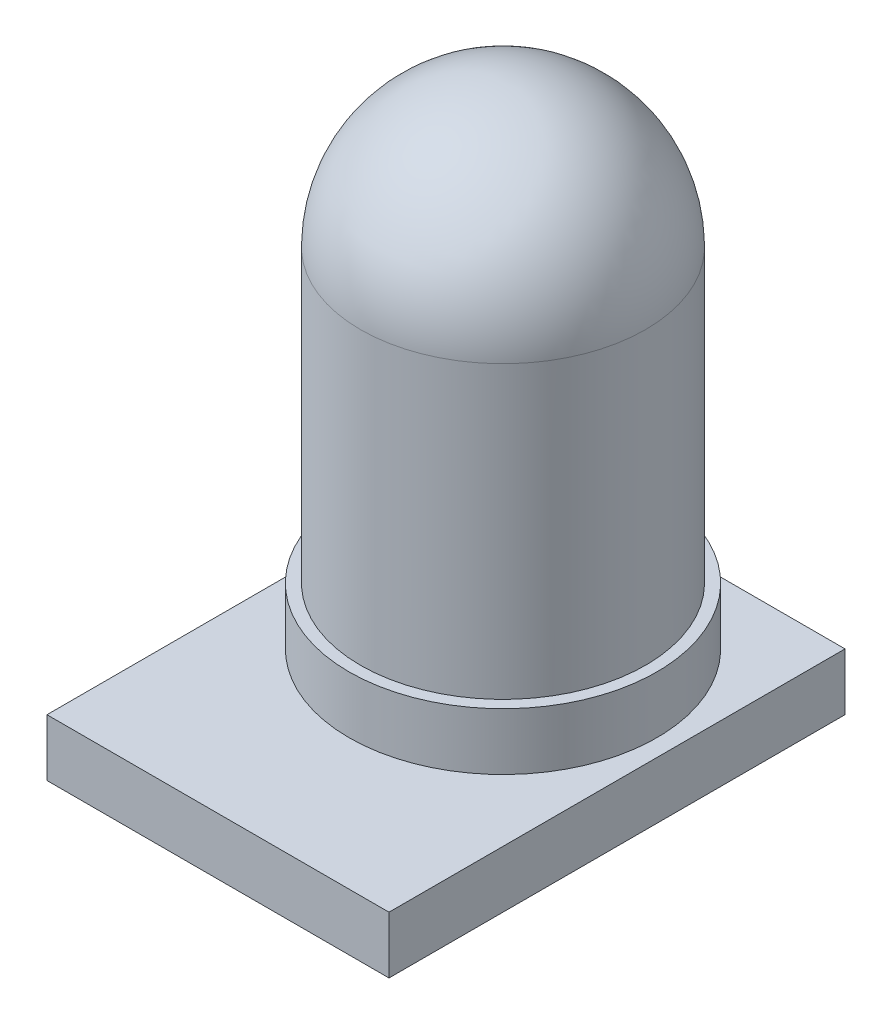
ISO-10303-21;
HEADER;
FILE_DESCRIPTION(('STEP AP214'),'2;1');
FILE_NAME('part.step','',(''),(''),'','','');
FILE_SCHEMA(('AUTOMOTIVE_DESIGN { 1 0 10303 214 1 1 1 1 }'));
ENDSEC;
DATA;
#1=APPLICATION_CONTEXT('core data for automotive mechanical design processes');
#2=APPLICATION_PROTOCOL_DEFINITION('international standard','automotive_design',2000,#1);
#3=PRODUCT_CONTEXT('',#1,'mechanical');
#4=PRODUCT('Part','Part','',(#3));
#5=PRODUCT_RELATED_PRODUCT_CATEGORY('part','',(#4));
#6=PRODUCT_DEFINITION_FORMATION('','',#4);
#7=PRODUCT_DEFINITION_CONTEXT('part definition',#1,'design');
#8=PRODUCT_DEFINITION('design','',#6,#7);
#9=PRODUCT_DEFINITION_SHAPE('','',#8);
#10=(LENGTH_UNIT() NAMED_UNIT(*) SI_UNIT(.MILLI.,.METRE.));
#11=(NAMED_UNIT(*) PLANE_ANGLE_UNIT() SI_UNIT($,.RADIAN.));
#12=(NAMED_UNIT(*) SI_UNIT($,.STERADIAN.) SOLID_ANGLE_UNIT());
#13=UNCERTAINTY_MEASURE_WITH_UNIT(LENGTH_MEASURE(1.E-05),#10,'distance_accuracy_value','');
#14=(GEOMETRIC_REPRESENTATION_CONTEXT(3) GLOBAL_UNCERTAINTY_ASSIGNED_CONTEXT((#13)) GLOBAL_UNIT_ASSIGNED_CONTEXT((#10,
#11,#12)) REPRESENTATION_CONTEXT('',''));
#15=CARTESIAN_POINT('',(0.,0.,0.));
#16=DIRECTION('',(0.,0.,1.));
#17=DIRECTION('',(1.,0.,0.));
#18=AXIS2_PLACEMENT_3D('',#15,#16,#17);
#19=CARTESIAN_POINT('',(3.,-1.,-3.));
#20=DIRECTION('',(-1.,0.,0.));
#21=DIRECTION('',(0.,0.,1.));
#22=AXIS2_PLACEMENT_3D('',#19,#20,#21);
#23=PLANE('',#22);
#24=DIRECTION('',(0.,0.,1.));
#25=VECTOR('',#24,1.);
#26=CARTESIAN_POINT('',(3.,0.,-3.));
#27=LINE('',#26,#25);
#28=CARTESIAN_POINT('',(3.,0.,-3.));
#29=VERTEX_POINT('',#28);
#30=CARTESIAN_POINT('',(3.,0.,5.));
#31=VERTEX_POINT('',#30);
#32=EDGE_CURVE('E104',#29,#31,#27,.T.);
#33=ORIENTED_EDGE('',*,*,#32,.T.);
#34=DIRECTION('',(0.,1.,0.));
#35=VECTOR('',#34,1.);
#36=CARTESIAN_POINT('',(3.,-1.,5.));
#37=LINE('',#36,#35);
#38=CARTESIAN_POINT('',(3.,-1.,5.));
#39=VERTEX_POINT('',#38);
#40=EDGE_CURVE('E95',#39,#31,#37,.T.);
#41=ORIENTED_EDGE('',*,*,#40,.F.);
#42=DIRECTION('',(0.,0.,1.));
#43=VECTOR('',#42,1.);
#44=CARTESIAN_POINT('',(3.,-1.,-3.));
#45=LINE('',#44,#43);
#46=CARTESIAN_POINT('',(3.,-1.,-3.));
#47=VERTEX_POINT('',#46);
#48=EDGE_CURVE('E87',#47,#39,#45,.T.);
#49=ORIENTED_EDGE('',*,*,#48,.F.);
#50=DIRECTION('',(0.,1.,0.));
#51=VECTOR('',#50,1.);
#52=CARTESIAN_POINT('',(3.,-1.,-3.));
#53=LINE('',#52,#51);
#54=EDGE_CURVE('E100',#47,#29,#53,.T.);
#55=ORIENTED_EDGE('',*,*,#54,.T.);
#56=EDGE_LOOP('',(#33,#41,#49,#55));
#57=FACE_BOUND('',#56,.T.);
#58=ADVANCED_FACE('F34',(#57),#23,.F.);
#59=CARTESIAN_POINT('',(0.,-1.,5.));
#60=DIRECTION('',(0.,0.,-1.));
#61=DIRECTION('',(-1.,0.,0.));
#62=AXIS2_PLACEMENT_3D('',#59,#60,#61);
#63=PLANE('',#62);
#64=DIRECTION('',(-1.,0.,0.));
#65=VECTOR('',#64,1.);
#66=CARTESIAN_POINT('',(0.,0.,5.));
#67=LINE('',#66,#65);
#68=CARTESIAN_POINT('',(-3.,0.,5.));
#69=VERTEX_POINT('',#68);
#70=EDGE_CURVE('E93',#31,#69,#67,.T.);
#71=ORIENTED_EDGE('',*,*,#70,.T.);
#72=DIRECTION('',(0.,1.,0.));
#73=VECTOR('',#72,1.);
#74=CARTESIAN_POINT('',(-3.,-1.,5.));
#75=LINE('',#74,#73);
#76=CARTESIAN_POINT('',(-3.,-1.,5.));
#77=VERTEX_POINT('',#76);
#78=EDGE_CURVE('E91',#77,#69,#75,.T.);
#79=ORIENTED_EDGE('',*,*,#78,.F.);
#80=DIRECTION('',(-1.,0.,0.));
#81=VECTOR('',#80,1.);
#82=CARTESIAN_POINT('',(3.,-1.,5.));
#83=LINE('',#82,#81);
#84=EDGE_CURVE('E81',#39,#77,#83,.T.);
#85=ORIENTED_EDGE('',*,*,#84,.F.);
#86=ORIENTED_EDGE('',*,*,#40,.T.);
#87=EDGE_LOOP('',(#71,#79,#85,#86));
#88=FACE_BOUND('',#87,.T.);
#89=ADVANCED_FACE('F92',(#88),#63,.F.);
#90=CARTESIAN_POINT('',(-3.,-1.,5.));
#91=DIRECTION('',(1.,0.,0.));
#92=DIRECTION('',(0.,0.,-1.));
#93=AXIS2_PLACEMENT_3D('',#90,#91,#92);
#94=PLANE('',#93);
#95=DIRECTION('',(0.,0.,-1.));
#96=VECTOR('',#95,1.);
#97=CARTESIAN_POINT('',(-3.,0.,5.));
#98=LINE('',#97,#96);
#99=CARTESIAN_POINT('',(-3.,0.,-3.));
#100=VERTEX_POINT('',#99);
#101=EDGE_CURVE('E108',#69,#100,#98,.T.);
#102=ORIENTED_EDGE('',*,*,#101,.T.);
#103=DIRECTION('',(0.,1.,0.));
#104=VECTOR('',#103,1.);
#105=CARTESIAN_POINT('',(-3.,-1.,-3.));
#106=LINE('',#105,#104);
#107=CARTESIAN_POINT('',(-3.,-1.,-3.));
#108=VERTEX_POINT('',#107);
#109=EDGE_CURVE('E96',#108,#100,#106,.T.);
#110=ORIENTED_EDGE('',*,*,#109,.F.);
#111=DIRECTION('',(0.,0.,-1.));
#112=VECTOR('',#111,1.);
#113=CARTESIAN_POINT('',(-3.,-1.,5.));
#114=LINE('',#113,#112);
#115=EDGE_CURVE('E84',#77,#108,#114,.T.);
#116=ORIENTED_EDGE('',*,*,#115,.F.);
#117=ORIENTED_EDGE('',*,*,#78,.T.);
#118=EDGE_LOOP('',(#102,#110,#116,#117));
#119=FACE_BOUND('',#118,.T.);
#120=ADVANCED_FACE('F98',(#119),#94,.F.);
#121=CARTESIAN_POINT('',(0.,-1.,-3.));
#122=DIRECTION('',(0.,0.,1.));
#123=DIRECTION('',(1.,0.,0.));
#124=AXIS2_PLACEMENT_3D('',#121,#122,#123);
#125=PLANE('',#124);
#126=DIRECTION('',(1.,0.,0.));
#127=VECTOR('',#126,1.);
#128=CARTESIAN_POINT('',(0.,0.,-3.));
#129=LINE('',#128,#127);
#130=EDGE_CURVE('E69',#100,#29,#129,.T.);
#131=ORIENTED_EDGE('',*,*,#130,.T.);
#132=ORIENTED_EDGE('',*,*,#54,.F.);
#133=DIRECTION('',(1.,0.,0.));
#134=VECTOR('',#133,1.);
#135=CARTESIAN_POINT('',(-3.,-1.,-3.));
#136=LINE('',#135,#134);
#137=EDGE_CURVE('E52',#108,#47,#136,.T.);
#138=ORIENTED_EDGE('',*,*,#137,.F.);
#139=ORIENTED_EDGE('',*,*,#109,.T.);
#140=EDGE_LOOP('',(#131,#132,#138,#139));
#141=FACE_BOUND('',#140,.T.);
#142=ADVANCED_FACE('F139',(#141),#125,.F.);
#143=CARTESIAN_POINT('',(0.,-1.,0.));
#144=DIRECTION('',(0.,-1.,0.));
#145=DIRECTION('',(0.,0.,-1.));
#146=AXIS2_PLACEMENT_3D('',#143,#144,#145);
#147=PLANE('',#146);
#148=ORIENTED_EDGE('',*,*,#48,.T.);
#149=ORIENTED_EDGE('',*,*,#84,.T.);
#150=ORIENTED_EDGE('',*,*,#115,.T.);
#151=ORIENTED_EDGE('',*,*,#137,.T.);
#152=EDGE_LOOP('',(#148,#149,#150,#151));
#153=FACE_BOUND('',#152,.T.);
#154=ADVANCED_FACE('F82',(#153),#147,.T.);
#155=CARTESIAN_POINT('',(0.,0.,0.));
#156=DIRECTION('',(0.,-1.,0.));
#157=DIRECTION('',(0.,0.,-1.));
#158=AXIS2_PLACEMENT_3D('',#155,#156,#157);
#159=PLANE('',#158);
#160=CARTESIAN_POINT('',(0.,0.,0.));
#161=DIRECTION('',(0.,-1.,0.));
#162=DIRECTION('',(0.,0.,-1.));
#163=AXIS2_PLACEMENT_3D('',#160,#161,#162);
#164=CIRCLE('',#163,2.7);
#165=CARTESIAN_POINT('',(0.,0.,-2.7));
#166=VERTEX_POINT('',#165);
#167=EDGE_CURVE('E11',#166,#166,#164,.F.);
#168=ORIENTED_EDGE('',*,*,#167,.F.);
#169=EDGE_LOOP('',(#168));
#170=FACE_BOUND('',#169,.T.);
#171=ORIENTED_EDGE('',*,*,#32,.F.);
#172=ORIENTED_EDGE('',*,*,#130,.F.);
#173=ORIENTED_EDGE('',*,*,#101,.F.);
#174=ORIENTED_EDGE('',*,*,#70,.F.);
#175=EDGE_LOOP('',(#171,#172,#173,#174));
#176=FACE_BOUND('',#175,.T.);
#177=ADVANCED_FACE('F142',(#170,#176),#159,.F.);
#178=CARTESIAN_POINT('',(0.,1.,0.));
#179=DIRECTION('',(0.,-1.,0.));
#180=DIRECTION('',(0.,0.,-1.));
#181=AXIS2_PLACEMENT_3D('',#178,#179,#180);
#182=CYLINDRICAL_SURFACE('',#181,2.7);
#183=CARTESIAN_POINT('',(0.,1.,0.));
#184=DIRECTION('',(0.,1.,0.));
#185=DIRECTION('',(0.,0.,1.));
#186=AXIS2_PLACEMENT_3D('',#183,#184,#185);
#187=CIRCLE('',#186,2.7);
#188=CARTESIAN_POINT('',(0.,1.,2.7));
#189=VERTEX_POINT('',#188);
#190=EDGE_CURVE('E155',#189,#189,#187,.T.);
#191=ORIENTED_EDGE('',*,*,#190,.F.);
#192=EDGE_LOOP('',(#191));
#193=FACE_BOUND('',#192,.T.);
#194=ORIENTED_EDGE('',*,*,#167,.T.);
#195=EDGE_LOOP('',(#194));
#196=FACE_BOUND('',#195,.T.);
#197=ADVANCED_FACE('F126',(#193,#196),#182,.T.);
#198=CARTESIAN_POINT('',(0.,1.,0.));
#199=DIRECTION('',(0.,1.,0.));
#200=DIRECTION('',(0.,0.,1.));
#201=AXIS2_PLACEMENT_3D('',#198,#199,#200);
#202=PLANE('',#201);
#203=CARTESIAN_POINT('',(0.,1.,0.));
#204=DIRECTION('',(0.,1.,0.));
#205=DIRECTION('',(0.,0.,1.));
#206=AXIS2_PLACEMENT_3D('',#203,#204,#205);
#207=CIRCLE('',#206,2.5);
#208=CARTESIAN_POINT('',(0.,1.,2.5));
#209=VERTEX_POINT('',#208);
#210=EDGE_CURVE('E38',#209,#209,#207,.T.);
#211=ORIENTED_EDGE('',*,*,#210,.F.);
#212=EDGE_LOOP('',(#211));
#213=FACE_BOUND('',#212,.T.);
#214=ORIENTED_EDGE('',*,*,#190,.T.);
#215=EDGE_LOOP('',(#214));
#216=FACE_BOUND('',#215,.T.);
#217=ADVANCED_FACE('F120',(#213,#216),#202,.T.);
#218=CARTESIAN_POINT('',(0.,6.1,0.));
#219=DIRECTION('',(0.,1.,0.));
#220=DIRECTION('',(0.,0.,1.));
#221=AXIS2_PLACEMENT_3D('',#218,#219,#220);
#222=SPHERICAL_SURFACE('',#221,2.5);
#223=CARTESIAN_POINT('',(0.,6.1,0.));
#224=DIRECTION('',(0.,-1.,0.));
#225=DIRECTION('',(0.,0.,-1.));
#226=AXIS2_PLACEMENT_3D('',#223,#224,#225);
#227=CIRCLE('',#226,2.5);
#228=CARTESIAN_POINT('',(0.,6.1,-2.5));
#229=VERTEX_POINT('',#228);
#230=EDGE_CURVE('E44',#229,#229,#227,.T.);
#231=ORIENTED_EDGE('',*,*,#230,.F.);
#232=EDGE_LOOP('',(#231));
#233=FACE_BOUND('',#232,.T.);
#234=ADVANCED_FACE('F36',(#233),#222,.T.);
#235=CARTESIAN_POINT('',(0.,8.6,0.));
#236=DIRECTION('',(0.,-1.,0.));
#237=DIRECTION('',(0.,0.,-1.));
#238=AXIS2_PLACEMENT_3D('',#235,#236,#237);
#239=CYLINDRICAL_SURFACE('',#238,2.5);
#240=ORIENTED_EDGE('',*,*,#210,.T.);
#241=EDGE_LOOP('',(#240));
#242=FACE_BOUND('',#241,.T.);
#243=ORIENTED_EDGE('',*,*,#230,.T.);
#244=EDGE_LOOP('',(#243));
#245=FACE_BOUND('',#244,.T.);
#246=ADVANCED_FACE('F117',(#242,#245),#239,.T.);
#247=CLOSED_SHELL('',(#58,#89,#120,#142,#154,#177,#197,#217,#234,#246));
#248=MANIFOLD_SOLID_BREP('B2',#247);
#249=ADVANCED_BREP_SHAPE_REPRESENTATION('',(#18,#248),#14);
#250=SHAPE_DEFINITION_REPRESENTATION(#9,#249);
ENDSEC;
END-ISO-10303-21;
